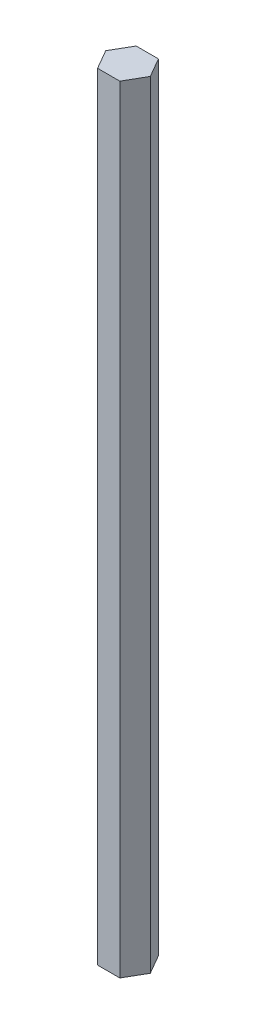
ISO-10303-21;
HEADER;
FILE_DESCRIPTION(('STEP AP214'),'2;1');
FILE_NAME('part.step','',(''),(''),'','','');
FILE_SCHEMA(('AUTOMOTIVE_DESIGN { 1 0 10303 214 1 1 1 1 }'));
ENDSEC;
DATA;
#1=APPLICATION_CONTEXT('core data for automotive mechanical design processes');
#2=APPLICATION_PROTOCOL_DEFINITION('international standard','automotive_design',2000,#1);
#3=PRODUCT_CONTEXT('',#1,'mechanical');
#4=PRODUCT('Part','Part','',(#3));
#5=PRODUCT_RELATED_PRODUCT_CATEGORY('part','',(#4));
#6=PRODUCT_DEFINITION_FORMATION('','',#4);
#7=PRODUCT_DEFINITION_CONTEXT('part definition',#1,'design');
#8=PRODUCT_DEFINITION('design','',#6,#7);
#9=PRODUCT_DEFINITION_SHAPE('','',#8);
#10=(LENGTH_UNIT() NAMED_UNIT(*) SI_UNIT(.MILLI.,.METRE.));
#11=(NAMED_UNIT(*) PLANE_ANGLE_UNIT() SI_UNIT($,.RADIAN.));
#12=(NAMED_UNIT(*) SI_UNIT($,.STERADIAN.) SOLID_ANGLE_UNIT());
#13=UNCERTAINTY_MEASURE_WITH_UNIT(LENGTH_MEASURE(1.E-05),#10,'distance_accuracy_value','');
#14=(GEOMETRIC_REPRESENTATION_CONTEXT(3) GLOBAL_UNCERTAINTY_ASSIGNED_CONTEXT((#13)) GLOBAL_UNIT_ASSIGNED_CONTEXT((#10,
#11,#12)) REPRESENTATION_CONTEXT('',''));
#15=CARTESIAN_POINT('',(0.,0.,0.));
#16=DIRECTION('',(0.,0.,1.));
#17=DIRECTION('',(1.,0.,0.));
#18=AXIS2_PLACEMENT_3D('',#15,#16,#17);
#19=CARTESIAN_POINT('',(3.66617420935418,127.824992,6.34999999999993));
#20=DIRECTION('',(-0.866025403784441,0.,-0.499999999999995));
#21=DIRECTION('',(-0.499999999999995,0.,0.866025403784442));
#22=AXIS2_PLACEMENT_3D('',#19,#20,#21);
#23=PLANE('',#22);
#24=DIRECTION('',(0.499999999999995,0.,-0.866025403784442));
#25=VECTOR('',#24,1.);
#26=CARTESIAN_POINT('',(3.66617420935418,-127.824992,6.34999999999993));
#27=LINE('',#26,#25);
#28=CARTESIAN_POINT('',(3.66617420935418,-127.824992,6.34999999999993));
#29=VERTEX_POINT('',#28);
#30=CARTESIAN_POINT('',(7.33234841870822,-127.824992,0.));
#31=VERTEX_POINT('',#30);
#32=EDGE_CURVE('E117',#29,#31,#27,.T.);
#33=ORIENTED_EDGE('',*,*,#32,.T.);
#34=DIRECTION('',(0.,-1.,0.));
#35=VECTOR('',#34,1.);
#36=CARTESIAN_POINT('',(7.33234841870822,127.824992,0.));
#37=LINE('',#36,#35);
#38=CARTESIAN_POINT('',(7.33234841870822,127.824992,0.));
#39=VERTEX_POINT('',#38);
#40=EDGE_CURVE('E11',#39,#31,#37,.T.);
#41=ORIENTED_EDGE('',*,*,#40,.F.);
#42=DIRECTION('',(0.499999999999995,0.,-0.866025403784442));
#43=VECTOR('',#42,1.);
#44=CARTESIAN_POINT('',(3.66617420935418,127.824992,6.34999999999993));
#45=LINE('',#44,#43);
#46=CARTESIAN_POINT('',(3.66617420935418,127.824992,6.34999999999993));
#47=VERTEX_POINT('',#46);
#48=EDGE_CURVE('E127',#47,#39,#45,.T.);
#49=ORIENTED_EDGE('',*,*,#48,.F.);
#50=DIRECTION('',(0.,-1.,0.));
#51=VECTOR('',#50,1.);
#52=CARTESIAN_POINT('',(3.66617420935418,127.824992,6.34999999999993));
#53=LINE('',#52,#51);
#54=EDGE_CURVE('E113',#47,#29,#53,.T.);
#55=ORIENTED_EDGE('',*,*,#54,.T.);
#56=EDGE_LOOP('',(#33,#41,#49,#55));
#57=FACE_BOUND('',#56,.T.);
#58=ADVANCED_FACE('F33',(#57),#23,.F.);
#59=CARTESIAN_POINT('',(7.33234841870822,127.824992,0.));
#60=DIRECTION('',(-0.866025403784438,0.,0.500000000000001));
#61=DIRECTION('',(0.500000000000001,0.,0.866025403784438));
#62=AXIS2_PLACEMENT_3D('',#59,#60,#61);
#63=PLANE('',#62);
#64=DIRECTION('',(-0.500000000000001,0.,-0.866025403784438));
#65=VECTOR('',#64,1.);
#66=CARTESIAN_POINT('',(7.33234841870822,-127.824992,0.));
#67=LINE('',#66,#65);
#68=CARTESIAN_POINT('',(3.66617420935409,-127.824992,-6.34999999999998));
#69=VERTEX_POINT('',#68);
#70=EDGE_CURVE('E120',#31,#69,#67,.T.);
#71=ORIENTED_EDGE('',*,*,#70,.T.);
#72=DIRECTION('',(0.,-1.,0.));
#73=VECTOR('',#72,1.);
#74=CARTESIAN_POINT('',(3.66617420935409,127.824992,-6.34999999999998));
#75=LINE('',#74,#73);
#76=CARTESIAN_POINT('',(3.66617420935409,127.824992,-6.34999999999998));
#77=VERTEX_POINT('',#76);
#78=EDGE_CURVE('E41',#77,#69,#75,.T.);
#79=ORIENTED_EDGE('',*,*,#78,.F.);
#80=DIRECTION('',(-0.500000000000001,0.,-0.866025403784438));
#81=VECTOR('',#80,1.);
#82=CARTESIAN_POINT('',(7.33234841870822,127.824992,0.));
#83=LINE('',#82,#81);
#84=EDGE_CURVE('E86',#39,#77,#83,.T.);
#85=ORIENTED_EDGE('',*,*,#84,.F.);
#86=ORIENTED_EDGE('',*,*,#40,.T.);
#87=EDGE_LOOP('',(#71,#79,#85,#86));
#88=FACE_BOUND('',#87,.T.);
#89=ADVANCED_FACE('F151',(#88),#63,.F.);
#90=CARTESIAN_POINT('',(3.66617420935409,127.824992,-6.34999999999998));
#91=DIRECTION('',(0.,0.,1.));
#92=DIRECTION('',(1.,0.,0.));
#93=AXIS2_PLACEMENT_3D('',#90,#91,#92);
#94=PLANE('',#93);
#95=DIRECTION('',(-1.,0.,0.));
#96=VECTOR('',#95,1.);
#97=CARTESIAN_POINT('',(3.66617420935409,-127.824992,-6.34999999999998));
#98=LINE('',#97,#96);
#99=CARTESIAN_POINT('',(-3.66617420935414,-127.824992,-6.34999999999996));
#100=VERTEX_POINT('',#99);
#101=EDGE_CURVE('E122',#69,#100,#98,.T.);
#102=ORIENTED_EDGE('',*,*,#101,.T.);
#103=DIRECTION('',(0.,-1.,0.));
#104=VECTOR('',#103,1.);
#105=CARTESIAN_POINT('',(-3.66617420935414,127.824992,-6.34999999999996));
#106=LINE('',#105,#104);
#107=CARTESIAN_POINT('',(-3.66617420935414,127.824992,-6.34999999999996));
#108=VERTEX_POINT('',#107);
#109=EDGE_CURVE('E108',#108,#100,#106,.T.);
#110=ORIENTED_EDGE('',*,*,#109,.F.);
#111=DIRECTION('',(-1.,0.,0.));
#112=VECTOR('',#111,1.);
#113=CARTESIAN_POINT('',(3.66617420935409,127.824992,-6.34999999999998));
#114=LINE('',#113,#112);
#115=EDGE_CURVE('E99',#77,#108,#114,.T.);
#116=ORIENTED_EDGE('',*,*,#115,.F.);
#117=ORIENTED_EDGE('',*,*,#78,.T.);
#118=EDGE_LOOP('',(#102,#110,#116,#117));
#119=FACE_BOUND('',#118,.T.);
#120=ADVANCED_FACE('F133',(#119),#94,.F.);
#121=CARTESIAN_POINT('',(-3.66617420935414,127.824992,-6.34999999999996));
#122=DIRECTION('',(0.866025403784441,0.,0.499999999999995));
#123=DIRECTION('',(0.499999999999995,0.,-0.866025403784442));
#124=AXIS2_PLACEMENT_3D('',#121,#122,#123);
#125=PLANE('',#124);
#126=DIRECTION('',(-0.499999999999995,0.,0.866025403784441));
#127=VECTOR('',#126,1.);
#128=CARTESIAN_POINT('',(-3.66617420935414,-127.824992,-6.34999999999996));
#129=LINE('',#128,#127);
#130=CARTESIAN_POINT('',(-7.33234841870822,-127.824992,0.));
#131=VERTEX_POINT('',#130);
#132=EDGE_CURVE('E107',#100,#131,#129,.T.);
#133=ORIENTED_EDGE('',*,*,#132,.T.);
#134=DIRECTION('',(0.,-1.,0.));
#135=VECTOR('',#134,1.);
#136=CARTESIAN_POINT('',(-7.33234841870822,127.824992,0.));
#137=LINE('',#136,#135);
#138=CARTESIAN_POINT('',(-7.33234841870822,127.824992,0.));
#139=VERTEX_POINT('',#138);
#140=EDGE_CURVE('E104',#139,#131,#137,.T.);
#141=ORIENTED_EDGE('',*,*,#140,.F.);
#142=DIRECTION('',(-0.499999999999995,0.,0.866025403784441));
#143=VECTOR('',#142,1.);
#144=CARTESIAN_POINT('',(-3.66617420935414,127.824992,-6.34999999999996));
#145=LINE('',#144,#143);
#146=EDGE_CURVE('E93',#108,#139,#145,.T.);
#147=ORIENTED_EDGE('',*,*,#146,.F.);
#148=ORIENTED_EDGE('',*,*,#109,.T.);
#149=EDGE_LOOP('',(#133,#141,#147,#148));
#150=FACE_BOUND('',#149,.T.);
#151=ADVANCED_FACE('F105',(#150),#125,.F.);
#152=CARTESIAN_POINT('',(-7.33234841870822,127.824992,0.));
#153=DIRECTION('',(0.866025403784435,0.,-0.500000000000007));
#154=DIRECTION('',(-0.500000000000007,0.,-0.866025403784435));
#155=AXIS2_PLACEMENT_3D('',#152,#153,#154);
#156=PLANE('',#155);
#157=DIRECTION('',(0.500000000000007,0.,0.866025403784435));
#158=VECTOR('',#157,1.);
#159=CARTESIAN_POINT('',(-7.33234841870822,-127.824992,0.));
#160=LINE('',#159,#158);
#161=CARTESIAN_POINT('',(-3.66617420935405,-127.824992,6.35000000000001));
#162=VERTEX_POINT('',#161);
#163=EDGE_CURVE('E72',#131,#162,#160,.T.);
#164=ORIENTED_EDGE('',*,*,#163,.T.);
#165=DIRECTION('',(0.,-1.,0.));
#166=VECTOR('',#165,1.);
#167=CARTESIAN_POINT('',(-3.66617420935405,127.824992,6.35000000000001));
#168=LINE('',#167,#166);
#169=CARTESIAN_POINT('',(-3.66617420935405,127.824992,6.35000000000001));
#170=VERTEX_POINT('',#169);
#171=EDGE_CURVE('E109',#170,#162,#168,.T.);
#172=ORIENTED_EDGE('',*,*,#171,.F.);
#173=DIRECTION('',(0.500000000000007,0.,0.866025403784435));
#174=VECTOR('',#173,1.);
#175=CARTESIAN_POINT('',(-7.33234841870822,127.824992,0.));
#176=LINE('',#175,#174);
#177=EDGE_CURVE('E97',#139,#170,#176,.T.);
#178=ORIENTED_EDGE('',*,*,#177,.F.);
#179=ORIENTED_EDGE('',*,*,#140,.T.);
#180=EDGE_LOOP('',(#164,#172,#178,#179));
#181=FACE_BOUND('',#180,.T.);
#182=ADVANCED_FACE('F111',(#181),#156,.F.);
#183=CARTESIAN_POINT('',(-3.66617420935405,127.824992,6.35000000000001));
#184=DIRECTION('',(0.,0.,-1.));
#185=DIRECTION('',(-1.,0.,0.));
#186=AXIS2_PLACEMENT_3D('',#183,#184,#185);
#187=PLANE('',#186);
#188=DIRECTION('',(1.,0.,0.));
#189=VECTOR('',#188,1.);
#190=CARTESIAN_POINT('',(-3.66617420935405,-127.824992,6.35000000000001));
#191=LINE('',#190,#189);
#192=EDGE_CURVE('E78',#162,#29,#191,.T.);
#193=ORIENTED_EDGE('',*,*,#192,.T.);
#194=ORIENTED_EDGE('',*,*,#54,.F.);
#195=DIRECTION('',(1.,0.,0.));
#196=VECTOR('',#195,1.);
#197=CARTESIAN_POINT('',(-3.66617420935405,127.824992,6.35000000000001));
#198=LINE('',#197,#196);
#199=EDGE_CURVE('E49',#170,#47,#198,.T.);
#200=ORIENTED_EDGE('',*,*,#199,.F.);
#201=ORIENTED_EDGE('',*,*,#171,.T.);
#202=EDGE_LOOP('',(#193,#194,#200,#201));
#203=FACE_BOUND('',#202,.T.);
#204=ADVANCED_FACE('F140',(#203),#187,.F.);
#205=CARTESIAN_POINT('',(0.,127.824992,0.));
#206=DIRECTION('',(0.,1.,0.));
#207=DIRECTION('',(0.,0.,1.));
#208=AXIS2_PLACEMENT_3D('',#205,#206,#207);
#209=PLANE('',#208);
#210=ORIENTED_EDGE('',*,*,#48,.T.);
#211=ORIENTED_EDGE('',*,*,#84,.T.);
#212=ORIENTED_EDGE('',*,*,#115,.T.);
#213=ORIENTED_EDGE('',*,*,#146,.T.);
#214=ORIENTED_EDGE('',*,*,#177,.T.);
#215=ORIENTED_EDGE('',*,*,#199,.T.);
#216=EDGE_LOOP('',(#210,#211,#212,#213,#214,#215));
#217=FACE_BOUND('',#216,.T.);
#218=ADVANCED_FACE('F95',(#217),#209,.T.);
#219=CARTESIAN_POINT('',(0.,-127.824992,0.));
#220=DIRECTION('',(0.,1.,0.));
#221=DIRECTION('',(0.,0.,1.));
#222=AXIS2_PLACEMENT_3D('',#219,#220,#221);
#223=PLANE('',#222);
#224=ORIENTED_EDGE('',*,*,#32,.F.);
#225=ORIENTED_EDGE('',*,*,#192,.F.);
#226=ORIENTED_EDGE('',*,*,#163,.F.);
#227=ORIENTED_EDGE('',*,*,#132,.F.);
#228=ORIENTED_EDGE('',*,*,#101,.F.);
#229=ORIENTED_EDGE('',*,*,#70,.F.);
#230=EDGE_LOOP('',(#224,#225,#226,#227,#228,#229));
#231=FACE_BOUND('',#230,.T.);
#232=ADVANCED_FACE('F136',(#231),#223,.F.);
#233=CLOSED_SHELL('',(#58,#89,#120,#151,#182,#204,#218,#232));
#234=MANIFOLD_SOLID_BREP('B2',#233);
#235=ADVANCED_BREP_SHAPE_REPRESENTATION('',(#18,#234),#14);
#236=SHAPE_DEFINITION_REPRESENTATION(#9,#235);
ENDSEC;
END-ISO-10303-21;
